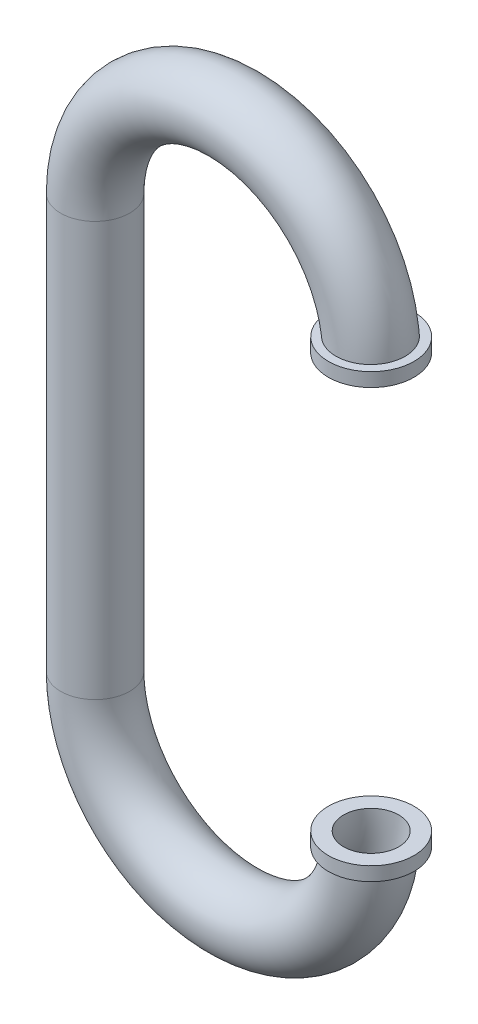
ISO-10303-21;
HEADER;
FILE_DESCRIPTION(('STEP AP214'),'2;1');
FILE_NAME('part.step','',(''),(''),'','','');
FILE_SCHEMA(('AUTOMOTIVE_DESIGN { 1 0 10303 214 1 1 1 1 }'));
ENDSEC;
DATA;
#1=APPLICATION_CONTEXT('core data for automotive mechanical design processes');
#2=APPLICATION_PROTOCOL_DEFINITION('international standard','automotive_design',2000,#1);
#3=PRODUCT_CONTEXT('',#1,'mechanical');
#4=PRODUCT('Part','Part','',(#3));
#5=PRODUCT_RELATED_PRODUCT_CATEGORY('part','',(#4));
#6=PRODUCT_DEFINITION_FORMATION('','',#4);
#7=PRODUCT_DEFINITION_CONTEXT('part definition',#1,'design');
#8=PRODUCT_DEFINITION('design','',#6,#7);
#9=PRODUCT_DEFINITION_SHAPE('','',#8);
#10=(LENGTH_UNIT() NAMED_UNIT(*) SI_UNIT(.MILLI.,.METRE.));
#11=(NAMED_UNIT(*) PLANE_ANGLE_UNIT() SI_UNIT($,.RADIAN.));
#12=(NAMED_UNIT(*) SI_UNIT($,.STERADIAN.) SOLID_ANGLE_UNIT());
#13=UNCERTAINTY_MEASURE_WITH_UNIT(LENGTH_MEASURE(1.E-05),#10,'distance_accuracy_value','');
#14=(GEOMETRIC_REPRESENTATION_CONTEXT(3) GLOBAL_UNCERTAINTY_ASSIGNED_CONTEXT((#13)) GLOBAL_UNIT_ASSIGNED_CONTEXT((#10,
#11,#12)) REPRESENTATION_CONTEXT('',''));
#15=CARTESIAN_POINT('',(0.,0.,0.));
#16=DIRECTION('',(0.,0.,1.));
#17=DIRECTION('',(1.,0.,0.));
#18=AXIS2_PLACEMENT_3D('',#15,#16,#17);
#19=CARTESIAN_POINT('',(-1.,-3.,0.));
#20=DIRECTION('',(0.,0.,1.));
#21=DIRECTION('',(1.,0.,0.));
#22=AXIS2_PLACEMENT_3D('',#19,#20,#21);
#23=TOROIDAL_SURFACE('',#22,1.,0.25);
#24=CARTESIAN_POINT('',(-2.,-3.,0.));
#25=DIRECTION('',(0.,1.,0.));
#26=DIRECTION('',(-1.,0.,0.));
#27=AXIS2_PLACEMENT_3D('',#24,#25,#26);
#28=CIRCLE('',#27,0.25);
#29=CARTESIAN_POINT('',(-2.25,-3.,0.));
#30=VERTEX_POINT('',#29);
#31=EDGE_CURVE('E10',#30,#30,#28,.F.);
#32=ORIENTED_EDGE('',*,*,#31,.T.);
#33=EDGE_LOOP('',(#32));
#34=FACE_BOUND('',#33,.T.);
#35=CARTESIAN_POINT('',(-0.201401096317609,-3.1,-0.156239637939055));
#36=CARTESIAN_POINT('',(-0.192515381744765,-3.1,-0.167252077609579));
#37=CARTESIAN_POINT('',(-0.182688455173982,-3.1,-0.177518916216291));
#38=CARTESIAN_POINT('',(-0.161440206396307,-3.1,-0.196263733860563));
#39=CARTESIAN_POINT('',(-0.150016831755686,-3.1,-0.20473937428031));
#40=CARTESIAN_POINT('',(-0.125918030893343,-3.1,-0.219650591642891));
#41=CARTESIAN_POINT('',(-0.113243480656999,-3.1,-0.226087582802604));
#42=CARTESIAN_POINT('',(-0.0869997655121405,-3.1,-0.236747922206686));
#43=CARTESIAN_POINT('',(-0.0734308362597756,-3.1,-0.240971850957425));
#44=CARTESIAN_POINT('',(-0.0457339019109194,-3.1,-0.247100376432861));
#45=CARTESIAN_POINT('',(-0.0316042741775116,-3.1,-0.248997644239264));
#46=CARTESIAN_POINT('',(-0.00322629205504432,-3.1,-0.25039290443244));
#47=CARTESIAN_POINT('',(0.0110220678837512,-3.1,-0.249890784032819));
#48=CARTESIAN_POINT('',(0.0392291333470105,-3.1,-0.246498215551317));
#49=CARTESIAN_POINT('',(0.0531878915474967,-3.1,-0.243608205779841));
#50=CARTESIAN_POINT('',(0.0804193255523234,-3.1,-0.235518387044002));
#51=CARTESIAN_POINT('',(0.0936920122085638,-3.1,-0.230318614626673));
#52=CARTESIAN_POINT('',(0.119130018612588,-3.1,-0.217773097139499));
#53=CARTESIAN_POINT('',(0.131298644924556,-3.1,-0.210434057268884));
#54=CARTESIAN_POINT('',(0.154224403610822,-3.1,-0.19380938875738));
#55=CARTESIAN_POINT('',(0.16498156794405,-3.1,-0.184523804203366));
#56=CARTESIAN_POINT('',(0.184732966605207,-3.1,-0.164309957154077));
#57=CARTESIAN_POINT('',(0.19373414042714,-3.1,-0.153388475286226));
#58=CARTESIAN_POINT('',(0.209767428801294,-3.1,-0.130184858647995));
#59=CARTESIAN_POINT('',(0.2167995799634,-3.1,-0.117902749181585));
#60=CARTESIAN_POINT('',(0.228669891476009,-3.1,-0.0923732303855612));
#61=CARTESIAN_POINT('',(0.233515686939351,-3.1,-0.0791293707956547));
#62=CARTESIAN_POINT('',(0.240909481174688,-3.1,-0.0520150874536926));
#63=CARTESIAN_POINT('',(0.243457513152715,-3.1,-0.0381446727593139));
#64=CARTESIAN_POINT('',(0.246179032531431,-3.1,-0.0102038849674363));
#65=CARTESIAN_POINT('',(0.246357758038782,-3.1,0.00386597816705059));
#66=CARTESIAN_POINT('',(0.244349055788095,-3.1,0.031835709221173));
#67=CARTESIAN_POINT('',(0.242161642062451,-3.1,0.0457355781484651));
#68=CARTESIAN_POINT('',(0.235485665649558,-3.1,0.0729628531749483));
#69=CARTESIAN_POINT('',(0.230998396510492,-3.1,0.0862905765141691));
#70=CARTESIAN_POINT('',(0.219852506415252,-3.1,0.112004722408348));
#71=CARTESIAN_POINT('',(0.213193879813402,-3.1,0.124391142515752));
#72=CARTESIAN_POINT('',(0.197887315423892,-3.1,0.147887218294668));
#73=CARTESIAN_POINT('',(0.189237089385645,-3.1,0.158995383124043));
#74=CARTESIAN_POINT('',(0.170199116558255,-3.1,0.179606640126358));
#75=CARTESIAN_POINT('',(0.159811350144781,-3.1,0.189109714168458));
#76=CARTESIAN_POINT('',(0.137563719486888,-3.1,0.206269460174095));
#77=CARTESIAN_POINT('',(0.125699938003297,-3.1,0.213921053042685));
#78=CARTESIAN_POINT('',(0.100860006511796,-3.1,0.227132541762658));
#79=CARTESIAN_POINT('',(0.0878838358654927,-3.1,0.232692398795301));
#80=CARTESIAN_POINT('',(0.0611348735671722,-3.1,0.241585432017897));
#81=CARTESIAN_POINT('',(0.0473592407953673,-3.1,0.24491006219374));
#82=CARTESIAN_POINT('',(0.019446046474218,-3.1,0.249209299271431));
#83=CARTESIAN_POINT('',(0.00530847649481506,-3.1,0.250183851386031));
#84=CARTESIAN_POINT('',(-0.0229863234276969,-3.1,0.249758171980877));
#85=CARTESIAN_POINT('',(-0.0371434135587133,-3.1,0.248348625861424));
#86=CARTESIAN_POINT('',(-0.0650217736945868,-3.1,0.243178774257247));
#87=CARTESIAN_POINT('',(-0.078743035543181,-3.1,0.239418424805864));
#88=CARTESIAN_POINT('',(-0.105393862649614,-3.1,0.229641253917731));
#89=CARTESIAN_POINT('',(-0.118321469988511,-3.1,0.223619093935772));
#90=CARTESIAN_POINT('',(-0.142980886757968,-3.1,0.209487505095425));
#91=CARTESIAN_POINT('',(-0.154712690478795,-3.1,0.20137806627133));
#92=CARTESIAN_POINT('',(-0.176629261017791,-3.1,0.183309172670559));
#93=CARTESIAN_POINT('',(-0.186815879412153,-3.1,0.173351964393591));
#94=CARTESIAN_POINT('',(-0.205361295947448,-3.1,0.15185994909619));
#95=CARTESIAN_POINT('',(-0.213720142578832,-3.1,0.140325183941254));
#96=CARTESIAN_POINT('',(-0.228318720410383,-3.1,0.116074864617453));
#97=CARTESIAN_POINT('',(-0.234570347456892,-3.1,0.10336647310674));
#98=CARTESIAN_POINT('',(-0.244831456650625,-3.1,0.0770751991823276));
#99=CARTESIAN_POINT('',(-0.248841143348115,-3.1,0.0634923966743228));
#100=CARTESIAN_POINT('',(-0.254473117176769,-3.1,0.0359545442264932));
#101=CARTESIAN_POINT('',(-0.256114330321349,-3.1,0.0220033627581726));
#102=CARTESIAN_POINT('',(-0.257019653071011,-3.1,-0.00597955267888357));
#103=CARTESIAN_POINT('',(-0.256283242576342,-3.1,-0.0200113036018263));
#104=CARTESIAN_POINT('',(-0.252463523074091,-3.1,-0.0476924426774221));
#105=CARTESIAN_POINT('',(-0.249389634653783,-3.1,-0.0613431382070541));
#106=CARTESIAN_POINT('',(-0.241000418891902,-3.1,-0.0879247327922063));
#107=CARTESIAN_POINT('',(-0.235687786658565,-3.1,-0.100856476238293));
#108=CARTESIAN_POINT('',(-0.225435869607466,-3.1,-0.120867695525504));
#109=CARTESIAN_POINT('',(-0.221139822061804,-3.1,-0.128284026486041));
#110=CARTESIAN_POINT('',(-0.211811113794151,-3.1,-0.142637803870627));
#111=CARTESIAN_POINT('',(-0.206778454833107,-3.1,-0.149575251439439));
#112=CARTESIAN_POINT('',(-0.201401096317609,-3.1,-0.156239637939055));
#113=B_SPLINE_CURVE_WITH_KNOTS('',3,(#35,#36,#37,#38,#39,#40,#41,#42,#43,#44,#45,#46,#47,#48,
#49,#50,#51,#52,#53,#54,#55,#56,#57,#58,#59,#60,#61,#62,#63,#64,#65,#66,#67,#68,#69,#70,#71,#72,
#73,#74,#75,#76,#77,#78,#79,#80,#81,#82,#83,#84,#85,#86,#87,#88,#89,#90,#91,#92,#93,#94,#95,#96,
#97,#98,#99,#100,#101,#102,#103,#104,#105,#106,#107,#108,#109,#110,#111,#112),.UNSPECIFIED.,.T.,
.F.,(4,2,2,2,2,2,2,2,2,2,2,2,2,2,2,2,2,2,2,2,2,2,2,2,2,2,2,2,2,2,2,2,2,2,2,2,2,2,4),(0.,
0.0424192772184809,0.084893600183786,0.127338393721264,0.169772048022751,0.21233902665477,
0.254908006223218,0.297469173753552,0.340029667868764,0.382458171419216,0.424885714119334,
0.467142031024321,0.509397562208715,0.551504365817851,0.593610560912517,0.635623651286504,
0.677636492503144,0.719625729586843,0.76161507584624,0.803652908716628,0.845691216407669,
0.88784357092604,0.929996707675384,0.972310107021951,1.01462449280908,1.05710458176961,
1.09958546525149,1.14216725288102,1.18474924382094,1.22727979920904,1.26980922613232,
1.3120943759003,1.35437566702383,1.39631718923709,1.43826788668425,1.48005040315259,
1.52178276285504,1.54745365347394,1.57312448272488),.UNSPECIFIED.);
#114=CARTESIAN_POINT('',(-0.201401096317609,-3.1,-0.156239637939055));
#115=VERTEX_POINT('',#114);
#116=EDGE_CURVE('E36',#115,#115,#113,.T.);
#117=ORIENTED_EDGE('',*,*,#116,.T.);
#118=EDGE_LOOP('',(#117));
#119=FACE_BOUND('',#118,.T.);
#120=ADVANCED_FACE('F31',(#34,#119),#23,.T.);
#121=CARTESIAN_POINT('',(-2.,0.,0.));
#122=DIRECTION('',(0.,-1.,0.));
#123=DIRECTION('',(1.,0.,0.));
#124=AXIS2_PLACEMENT_3D('',#121,#122,#123);
#125=CYLINDRICAL_SURFACE('',#124,0.25);
#126=CARTESIAN_POINT('',(-2.,0.,0.));
#127=DIRECTION('',(0.,-1.,0.));
#128=DIRECTION('',(1.,0.,0.));
#129=AXIS2_PLACEMENT_3D('',#126,#127,#128);
#130=CIRCLE('',#129,0.25);
#131=CARTESIAN_POINT('',(-1.75,0.,0.));
#132=VERTEX_POINT('',#131);
#133=EDGE_CURVE('E44',#132,#132,#130,.T.);
#134=ORIENTED_EDGE('',*,*,#133,.T.);
#135=EDGE_LOOP('',(#134));
#136=FACE_BOUND('',#135,.T.);
#137=ORIENTED_EDGE('',*,*,#31,.F.);
#138=EDGE_LOOP('',(#137));
#139=FACE_BOUND('',#138,.T.);
#140=ADVANCED_FACE('F92',(#136,#139),#125,.T.);
#141=CARTESIAN_POINT('',(-1.,0.,0.));
#142=DIRECTION('',(0.,0.,-1.));
#143=DIRECTION('',(-1.,0.,0.));
#144=AXIS2_PLACEMENT_3D('',#141,#142,#143);
#145=TOROIDAL_SURFACE('',#144,1.,0.25);
#146=CARTESIAN_POINT('',(-0.201401096317608,0.1,-0.156239637939055));
#147=CARTESIAN_POINT('',(-0.210190615714738,0.1,-0.145344468335609));
#148=CARTESIAN_POINT('',(-0.218071722109463,0.1,-0.133703962300581));
#149=CARTESIAN_POINT('',(-0.231777903107573,0.1,-0.109257379143088));
#150=CARTESIAN_POINT('',(-0.237600690405998,0.1,-0.0964500251078349));
#151=CARTESIAN_POINT('',(-0.247007650165606,0.1,-0.070038659789641));
#152=CARTESIAN_POINT('',(-0.250592194362358,0.1,-0.0564347812071184));
#153=CARTESIAN_POINT('',(-0.255413188399921,0.1,-0.0288206461573356));
#154=CARTESIAN_POINT('',(-0.256650230465359,0.1,-0.014810493090211));
#155=CARTESIAN_POINT('',(-0.25674012956133,0.1,0.01315381103874));
#156=CARTESIAN_POINT('',(-0.255603761287644,0.1,0.0271079282969862));
#157=CARTESIAN_POINT('',(-0.251003172674125,0.1,0.0546272137432172));
#158=CARTESIAN_POINT('',(-0.247538882318155,0.1,0.0681923702197628));
#159=CARTESIAN_POINT('',(-0.238388633745031,0.1,0.0945453892648772));
#160=CARTESIAN_POINT('',(-0.232703487129412,0.1,0.107333533818285));
#161=CARTESIAN_POINT('',(-0.219279773062284,0.1,0.131782096781473));
#162=CARTESIAN_POINT('',(-0.211541147629265,0.1,0.143442483335476));
#163=CARTESIAN_POINT('',(-0.194180832606932,0.1,0.16538311643698));
#164=CARTESIAN_POINT('',(-0.18454778916345,0.1,0.175654378083548));
#165=CARTESIAN_POINT('',(-0.163705864908683,0.1,0.194449314988614));
#166=CARTESIAN_POINT('',(-0.152496920871618,0.1,0.202972920096664));
#167=CARTESIAN_POINT('',(-0.128727432177818,0.1,0.218098495866874));
#168=CARTESIAN_POINT('',(-0.116157110459004,0.1,0.224685104803622));
#169=CARTESIAN_POINT('',(-0.0900925582958236,0.1,0.235665425768117));
#170=CARTESIAN_POINT('',(-0.0765983014200869,0.1,0.240059075031189));
#171=CARTESIAN_POINT('',(-0.0490037254832948,0.1,0.246545191192852));
#172=CARTESIAN_POINT('',(-0.0349009697958581,0.1,0.248627297728038));
#173=CARTESIAN_POINT('',(-0.00654593496886664,0.1,0.250394447161815));
#174=CARTESIAN_POINT('',(0.00770634481024836,0.1,0.250079479803207));
#175=CARTESIAN_POINT('',(0.0359552161641339,0.1,0.247058139402245));
#176=CARTESIAN_POINT('',(0.0499518104184513,0.1,0.244351791435899));
#177=CARTESIAN_POINT('',(0.0772894135497919,0.1,0.236620477359455));
#178=CARTESIAN_POINT('',(0.090630430890424,0.1,0.23159554119143));
#179=CARTESIAN_POINT('',(0.116234413487642,0.1,0.219384869006445));
#180=CARTESIAN_POINT('',(0.128500521169367,0.1,0.212205722852414));
#181=CARTESIAN_POINT('',(0.151646839119026,0.1,0.195882113872184));
#182=CARTESIAN_POINT('',(0.162527077997131,0.1,0.186737691628039));
#183=CARTESIAN_POINT('',(0.182546180432526,0.1,0.166782766405174));
#184=CARTESIAN_POINT('',(0.191691887715395,0.1,0.155979129073377));
#185=CARTESIAN_POINT('',(0.208031942604488,0.1,0.132985122648441));
#186=CARTESIAN_POINT('',(0.215226328920527,0.1,0.120794781071202));
#187=CARTESIAN_POINT('',(0.227433287128235,0.1,0.0954202629388038));
#188=CARTESIAN_POINT('',(0.232453530620286,0.1,0.0822397766594053));
#189=CARTESIAN_POINT('',(0.240204253167929,0.1,0.0552219448415193));
#190=CARTESIAN_POINT('',(0.242934765237328,0.1,0.0413846087766633));
#191=CARTESIAN_POINT('',(0.246023480720513,0.1,0.0134795739953028));
#192=CARTESIAN_POINT('',(0.246387057425578,0.1,-0.000587530219673264));
#193=CARTESIAN_POINT('',(0.244745727650856,0.1,-0.028582817719134));
#194=CARTESIAN_POINT('',(0.242740835396257,0.1,-0.0425110018374757));
#195=CARTESIAN_POINT('',(0.236422429745385,0.1,-0.0698241464986362));
#196=CARTESIAN_POINT('',(0.232110367704181,0.1,-0.0832094428634805));
#197=CARTESIAN_POINT('',(0.221302613835047,0.1,-0.109067212165587));
#198=CARTESIAN_POINT('',(0.21480691921559,0.1,-0.121539683935882));
#199=CARTESIAN_POINT('',(0.199809991107809,0.1,-0.145233133026621));
#200=CARTESIAN_POINT('',(0.191306581255811,0.1,-0.156452732655624));
#201=CARTESIAN_POINT('',(0.172541402772618,0.1,-0.177309784421281));
#202=CARTESIAN_POINT('',(0.162279611876264,0.1,-0.18694721652102));
#203=CARTESIAN_POINT('',(0.140260536178512,0.1,-0.20439458897411));
#204=CARTESIAN_POINT('',(0.128499350856914,0.1,-0.212199606378334));
#205=CARTESIAN_POINT('',(0.103837454519992,0.1,-0.225732886882564));
#206=CARTESIAN_POINT('',(0.0909367201277323,0.1,-0.231461107366438));
#207=CARTESIAN_POINT('',(0.0643098227029982,0.1,-0.240701650163389));
#208=CARTESIAN_POINT('',(0.0505807148736022,0.1,-0.244205486570355));
#209=CARTESIAN_POINT('',(0.0227304868784083,0.1,-0.248868281721869));
#210=CARTESIAN_POINT('',(0.00860937300525712,0.1,-0.250027278084741));
#211=CARTESIAN_POINT('',(-0.0196823103314641,0.1,-0.249971637934856));
#212=CARTESIAN_POINT('',(-0.0338528618381342,0.1,-0.248747884057992));
#213=CARTESIAN_POINT('',(-0.0617929096379458,0.1,-0.243944388235435));
#214=CARTESIAN_POINT('',(-0.0755622983800525,0.1,-0.240364020446176));
#215=CARTESIAN_POINT('',(-0.102345731745449,0.1,-0.230935097081438));
#216=CARTESIAN_POINT('',(-0.115357430686798,0.1,-0.225079887987269));
#217=CARTESIAN_POINT('',(-0.140200186875687,0.1,-0.211269182973001));
#218=CARTESIAN_POINT('',(-0.152032625018917,0.1,-0.203316184310893));
#219=CARTESIAN_POINT('',(-0.170150558895375,0.1,-0.188776882063845));
#220=CARTESIAN_POINT('',(-0.176888616987927,0.1,-0.182745072414765));
#221=CARTESIAN_POINT('',(-0.189677604716015,0.1,-0.169992202553551));
#222=CARTESIAN_POINT('',(-0.195728533355725,0.1,-0.163271141342543));
#223=CARTESIAN_POINT('',(-0.201401096317608,0.1,-0.156239637939055));
#224=B_SPLINE_CURVE_WITH_KNOTS('',3,(#146,#147,#148,#149,#150,#151,#152,#153,#154,#155,#156,
#157,#158,#159,#160,#161,#162,#163,#164,#165,#166,#167,#168,#169,#170,#171,#172,#173,#174,#175,
#176,#177,#178,#179,#180,#181,#182,#183,#184,#185,#186,#187,#188,#189,#190,#191,#192,#193,#194,
#195,#196,#197,#198,#199,#200,#201,#202,#203,#204,#205,#206,#207,#208,#209,#210,#211,#212,#213,
#214,#215,#216,#217,#218,#219,#220,#221,#222,#223),.UNSPECIFIED.,.T.,.F.,(4,2,2,2,2,2,2,2,2,2,2,
2,2,2,2,2,2,2,2,2,2,2,2,2,2,2,2,2,2,2,2,2,2,2,2,2,2,2,4),(0.,0.0419631052503927,
0.0839726964411998,0.125975308668973,0.167967323125762,0.209769118662524,0.251572171514233,
0.293359961905662,0.335148932332196,0.377196440897467,0.419245636907758,0.461619835954524,
0.503995247723258,0.54655982933734,0.589124593087473,0.631688910508933,0.6742526782734,
0.716687545691694,0.759121536933535,0.801384450217337,0.843646525038763,0.88575823574167,
0.927869339259047,0.969884810944664,1.01190003028372,1.05388885042508,1.09587772424463,
1.13791232469054,1.17994745743075,1.22209426111071,1.26424192959939,1.30654943795309,
1.34885626756105,1.39132529833847,1.43380561212635,1.47641112039157,1.51896613717817,
1.5460481653165,1.57313023270311),.UNSPECIFIED.);
#225=CARTESIAN_POINT('',(-0.201401096317608,0.1,-0.156239637939055));
#226=VERTEX_POINT('',#225);
#227=EDGE_CURVE('E53',#226,#226,#224,.T.);
#228=ORIENTED_EDGE('',*,*,#227,.T.);
#229=EDGE_LOOP('',(#228));
#230=FACE_BOUND('',#229,.T.);
#231=ORIENTED_EDGE('',*,*,#133,.F.);
#232=EDGE_LOOP('',(#231));
#233=FACE_BOUND('',#232,.T.);
#234=ADVANCED_FACE('F33',(#230,#233),#145,.T.);
#235=CARTESIAN_POINT('',(0.,-3.,0.));
#236=DIRECTION('',(0.,1.,0.));
#237=DIRECTION('',(0.,0.,1.));
#238=AXIS2_PLACEMENT_3D('',#235,#236,#237);
#239=PLANE('',#238);
#240=CARTESIAN_POINT('',(0.,-3.,0.));
#241=DIRECTION('',(0.,1.,0.));
#242=DIRECTION('',(0.,0.,1.));
#243=AXIS2_PLACEMENT_3D('',#240,#241,#242);
#244=CIRCLE('',#243,0.2);
#245=CARTESIAN_POINT('',(0.199999999999999,-3.,0.));
#246=VERTEX_POINT('',#245);
#247=EDGE_CURVE('E49',#246,#246,#244,.T.);
#248=ORIENTED_EDGE('',*,*,#247,.F.);
#249=EDGE_LOOP('',(#248));
#250=FACE_BOUND('',#249,.T.);
#251=CARTESIAN_POINT('',(0.,-3.,0.));
#252=DIRECTION('',(0.,1.,0.));
#253=DIRECTION('',(0.,0.,1.));
#254=AXIS2_PLACEMENT_3D('',#251,#252,#253);
#255=CIRCLE('',#254,0.31);
#256=CARTESIAN_POINT('',(0.,-3.,0.31));
#257=VERTEX_POINT('',#256);
#258=EDGE_CURVE('E204',#257,#257,#255,.T.);
#259=ORIENTED_EDGE('',*,*,#258,.T.);
#260=EDGE_LOOP('',(#259));
#261=FACE_BOUND('',#260,.T.);
#262=ADVANCED_FACE('F86',(#250,#261),#239,.T.);
#263=CARTESIAN_POINT('',(0.,0.,0.));
#264=DIRECTION('',(0.,1.,0.));
#265=DIRECTION('',(0.,0.,1.));
#266=AXIS2_PLACEMENT_3D('',#263,#264,#265);
#267=PLANE('',#266);
#268=CARTESIAN_POINT('',(0.,0.,0.));
#269=DIRECTION('',(0.,1.,0.));
#270=DIRECTION('',(0.,0.,1.));
#271=AXIS2_PLACEMENT_3D('',#268,#269,#270);
#272=CIRCLE('',#271,0.2);
#273=CARTESIAN_POINT('',(0.2,0.,0.));
#274=VERTEX_POINT('',#273);
#275=EDGE_CURVE('E58',#274,#274,#272,.T.);
#276=ORIENTED_EDGE('',*,*,#275,.T.);
#277=EDGE_LOOP('',(#276));
#278=FACE_BOUND('',#277,.T.);
#279=CARTESIAN_POINT('',(0.,0.,0.));
#280=DIRECTION('',(0.,1.,0.));
#281=DIRECTION('',(0.,0.,1.));
#282=AXIS2_PLACEMENT_3D('',#279,#280,#281);
#283=CIRCLE('',#282,0.31);
#284=CARTESIAN_POINT('',(0.,0.,0.31));
#285=VERTEX_POINT('',#284);
#286=EDGE_CURVE('E206',#285,#285,#283,.T.);
#287=ORIENTED_EDGE('',*,*,#286,.F.);
#288=EDGE_LOOP('',(#287));
#289=FACE_BOUND('',#288,.T.);
#290=ADVANCED_FACE('F82',(#278,#289),#267,.F.);
#291=CARTESIAN_POINT('',(-1.,-3.,0.));
#292=DIRECTION('',(0.,0.,1.));
#293=DIRECTION('',(1.,0.,0.));
#294=AXIS2_PLACEMENT_3D('',#291,#292,#293);
#295=TOROIDAL_SURFACE('',#294,1.,0.2);
#296=CARTESIAN_POINT('',(-2.,-3.,0.));
#297=DIRECTION('',(0.,-1.,0.));
#298=DIRECTION('',(0.,0.,1.));
#299=AXIS2_PLACEMENT_3D('',#296,#297,#298);
#300=CIRCLE('',#299,0.2);
#301=CARTESIAN_POINT('',(-2.2,-3.,0.));
#302=VERTEX_POINT('',#301);
#303=EDGE_CURVE('E218',#302,#302,#300,.T.);
#304=CARTESIAN_POINT('',(-1.,-3.,0.));
#305=DIRECTION('',(0.,0.,1.));
#306=DIRECTION('',(1.,0.,0.));
#307=AXIS2_PLACEMENT_3D('',#304,#305,#306);
#308=CIRCLE('',#307,1.2);
#309=EDGE_CURVE('',#302,#246,#308,.T.);
#310=ORIENTED_EDGE('',*,*,#303,.F.);
#311=ORIENTED_EDGE('',*,*,#247,.T.);
#312=ORIENTED_EDGE('',*,*,#309,.T.);
#313=ORIENTED_EDGE('',*,*,#309,.F.);
#314=EDGE_LOOP('',(#310,#312,#311,#313));
#315=FACE_BOUND('',#314,.T.);
#316=ADVANCED_FACE('F78',(#315),#295,.F.);
#317=CARTESIAN_POINT('',(-2.,0.,0.));
#318=DIRECTION('',(0.,-1.,0.));
#319=DIRECTION('',(1.,0.,0.));
#320=AXIS2_PLACEMENT_3D('',#317,#318,#319);
#321=CYLINDRICAL_SURFACE('',#320,0.2);
#322=CARTESIAN_POINT('',(-2.,0.,0.));
#323=DIRECTION('',(0.,-1.,0.));
#324=DIRECTION('',(0.,0.,1.));
#325=AXIS2_PLACEMENT_3D('',#322,#323,#324);
#326=CIRCLE('',#325,0.2);
#327=CARTESIAN_POINT('',(-2.2,0.,0.));
#328=VERTEX_POINT('',#327);
#329=EDGE_CURVE('E216',#328,#328,#326,.T.);
#330=ORIENTED_EDGE('',*,*,#329,.F.);
#331=EDGE_LOOP('',(#330));
#332=FACE_BOUND('',#331,.T.);
#333=ORIENTED_EDGE('',*,*,#303,.T.);
#334=EDGE_LOOP('',(#333));
#335=FACE_BOUND('',#334,.T.);
#336=ADVANCED_FACE('F74',(#332,#335),#321,.F.);
#337=CARTESIAN_POINT('',(-1.,0.,0.));
#338=DIRECTION('',(0.,0.,1.));
#339=DIRECTION('',(1.,0.,0.));
#340=AXIS2_PLACEMENT_3D('',#337,#338,#339);
#341=TOROIDAL_SURFACE('',#340,1.,0.2);
#342=CARTESIAN_POINT('',(-1.,0.,0.));
#343=DIRECTION('',(0.,0.,1.));
#344=DIRECTION('',(1.,0.,0.));
#345=AXIS2_PLACEMENT_3D('',#342,#343,#344);
#346=CIRCLE('',#345,1.2);
#347=EDGE_CURVE('',#274,#328,#346,.T.);
#348=ORIENTED_EDGE('',*,*,#275,.F.);
#349=ORIENTED_EDGE('',*,*,#329,.T.);
#350=ORIENTED_EDGE('',*,*,#347,.T.);
#351=ORIENTED_EDGE('',*,*,#347,.F.);
#352=EDGE_LOOP('',(#348,#350,#349,#351));
#353=FACE_BOUND('',#352,.T.);
#354=ADVANCED_FACE('F66',(#353),#341,.F.);
#355=CARTESIAN_POINT('',(0.,0.1,0.));
#356=DIRECTION('',(0.,1.,0.));
#357=DIRECTION('',(0.,0.,1.));
#358=AXIS2_PLACEMENT_3D('',#355,#356,#357);
#359=PLANE('',#358);
#360=CARTESIAN_POINT('',(0.,0.1,0.));
#361=DIRECTION('',(0.,1.,0.));
#362=DIRECTION('',(0.,0.,1.));
#363=AXIS2_PLACEMENT_3D('',#360,#361,#362);
#364=CIRCLE('',#363,0.31);
#365=CARTESIAN_POINT('',(0.,0.1,0.31));
#366=VERTEX_POINT('',#365);
#367=EDGE_CURVE('E59',#366,#366,#364,.T.);
#368=ORIENTED_EDGE('',*,*,#367,.T.);
#369=EDGE_LOOP('',(#368));
#370=FACE_BOUND('',#369,.T.);
#371=ORIENTED_EDGE('',*,*,#227,.F.);
#372=EDGE_LOOP('',(#371));
#373=FACE_BOUND('',#372,.T.);
#374=ADVANCED_FACE('F60',(#370,#373),#359,.T.);
#375=CARTESIAN_POINT('',(0.,0.1,0.));
#376=DIRECTION('',(0.,-1.,0.));
#377=DIRECTION('',(0.,0.,-1.));
#378=AXIS2_PLACEMENT_3D('',#375,#376,#377);
#379=CYLINDRICAL_SURFACE('',#378,0.31);
#380=ORIENTED_EDGE('',*,*,#367,.F.);
#381=EDGE_LOOP('',(#380));
#382=FACE_BOUND('',#381,.T.);
#383=ORIENTED_EDGE('',*,*,#286,.T.);
#384=EDGE_LOOP('',(#383));
#385=FACE_BOUND('',#384,.T.);
#386=ADVANCED_FACE('F65',(#382,#385),#379,.T.);
#387=CARTESIAN_POINT('',(0.,-3.1,0.));
#388=DIRECTION('',(0.,1.,0.));
#389=DIRECTION('',(-1.,0.,0.));
#390=AXIS2_PLACEMENT_3D('',#387,#388,#389);
#391=CYLINDRICAL_SURFACE('',#390,0.31);
#392=CARTESIAN_POINT('',(0.,-3.1,0.));
#393=DIRECTION('',(0.,1.,0.));
#394=DIRECTION('',(0.,0.,1.));
#395=AXIS2_PLACEMENT_3D('',#392,#393,#394);
#396=CIRCLE('',#395,0.31);
#397=CARTESIAN_POINT('',(0.,-3.1,0.31));
#398=VERTEX_POINT('',#397);
#399=EDGE_CURVE('E203',#398,#398,#396,.T.);
#400=ORIENTED_EDGE('',*,*,#399,.T.);
#401=EDGE_LOOP('',(#400));
#402=FACE_BOUND('',#401,.T.);
#403=ORIENTED_EDGE('',*,*,#258,.F.);
#404=EDGE_LOOP('',(#403));
#405=FACE_BOUND('',#404,.T.);
#406=ADVANCED_FACE('F68',(#402,#405),#391,.T.);
#407=CARTESIAN_POINT('',(0.,-3.1,0.));
#408=DIRECTION('',(0.,1.,0.));
#409=DIRECTION('',(0.,0.,1.));
#410=AXIS2_PLACEMENT_3D('',#407,#408,#409);
#411=PLANE('',#410);
#412=ORIENTED_EDGE('',*,*,#116,.F.);
#413=EDGE_LOOP('',(#412));
#414=FACE_BOUND('',#413,.T.);
#415=ORIENTED_EDGE('',*,*,#399,.F.);
#416=EDGE_LOOP('',(#415));
#417=FACE_BOUND('',#416,.T.);
#418=ADVANCED_FACE('F141',(#414,#417),#411,.F.);
#419=CLOSED_SHELL('',(#120,#140,#234,#262,#290,#316,#336,#354,#374,#386,#406,#418));
#420=MANIFOLD_SOLID_BREP('B2',#419);
#421=ADVANCED_BREP_SHAPE_REPRESENTATION('',(#18,#420),#14);
#422=SHAPE_DEFINITION_REPRESENTATION(#9,#421);
ENDSEC;
END-ISO-10303-21;
